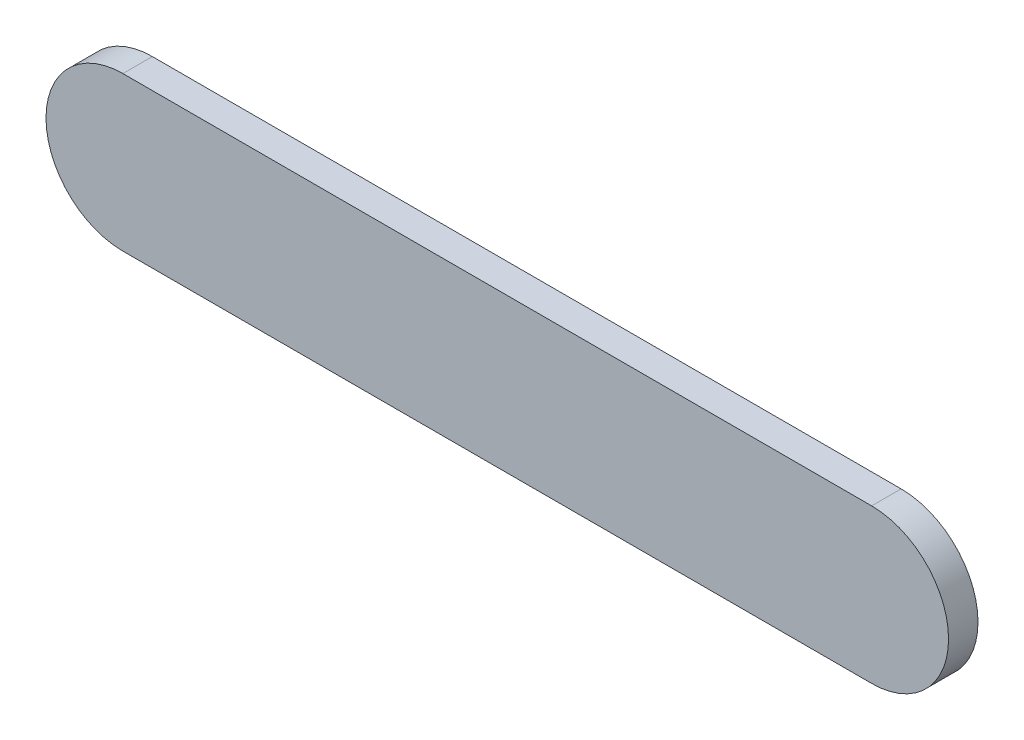
ISO-10303-21;
HEADER;
FILE_DESCRIPTION(('STEP AP214'),'2;1');
FILE_NAME('part.step','',(''),(''),'','','');
FILE_SCHEMA(('AUTOMOTIVE_DESIGN { 1 0 10303 214 1 1 1 1 }'));
ENDSEC;
DATA;
#1=APPLICATION_CONTEXT('core data for automotive mechanical design processes');
#2=APPLICATION_PROTOCOL_DEFINITION('international standard','automotive_design',2000,#1);
#3=PRODUCT_CONTEXT('',#1,'mechanical');
#4=PRODUCT('Part','Part','',(#3));
#5=PRODUCT_RELATED_PRODUCT_CATEGORY('part','',(#4));
#6=PRODUCT_DEFINITION_FORMATION('','',#4);
#7=PRODUCT_DEFINITION_CONTEXT('part definition',#1,'design');
#8=PRODUCT_DEFINITION('design','',#6,#7);
#9=PRODUCT_DEFINITION_SHAPE('','',#8);
#10=(LENGTH_UNIT() NAMED_UNIT(*) SI_UNIT(.MILLI.,.METRE.));
#11=(NAMED_UNIT(*) PLANE_ANGLE_UNIT() SI_UNIT($,.RADIAN.));
#12=(NAMED_UNIT(*) SI_UNIT($,.STERADIAN.) SOLID_ANGLE_UNIT());
#13=UNCERTAINTY_MEASURE_WITH_UNIT(LENGTH_MEASURE(1.E-05),#10,'distance_accuracy_value','');
#14=(GEOMETRIC_REPRESENTATION_CONTEXT(3) GLOBAL_UNCERTAINTY_ASSIGNED_CONTEXT((#13)) GLOBAL_UNIT_ASSIGNED_CONTEXT((#10,
#11,#12)) REPRESENTATION_CONTEXT('',''));
#15=CARTESIAN_POINT('',(0.,0.,0.));
#16=DIRECTION('',(0.,0.,1.));
#17=DIRECTION('',(1.,0.,0.));
#18=AXIS2_PLACEMENT_3D('',#15,#16,#17);
#19=CARTESIAN_POINT('',(0.,0.,6.));
#20=DIRECTION('',(0.,0.,-1.));
#21=DIRECTION('',(-1.,0.,0.));
#22=AXIS2_PLACEMENT_3D('',#19,#20,#21);
#23=CYLINDRICAL_SURFACE('',#22,15.66);
#24=CARTESIAN_POINT('',(0.,0.,0.));
#25=DIRECTION('',(0.,0.,1.));
#26=DIRECTION('',(1.,0.,0.));
#27=AXIS2_PLACEMENT_3D('',#24,#25,#26);
#28=CIRCLE('',#27,15.66);
#29=CARTESIAN_POINT('',(0.,15.66,0.));
#30=VERTEX_POINT('',#29);
#31=CARTESIAN_POINT('',(0.,-15.66,0.));
#32=VERTEX_POINT('',#31);
#33=EDGE_CURVE('E98',#30,#32,#28,.T.);
#34=ORIENTED_EDGE('',*,*,#33,.T.);
#35=DIRECTION('',(0.,0.,-1.));
#36=VECTOR('',#35,1.);
#37=CARTESIAN_POINT('',(0.,-15.66,6.));
#38=LINE('',#37,#36);
#39=CARTESIAN_POINT('',(0.,-15.66,6.));
#40=VERTEX_POINT('',#39);
#41=EDGE_CURVE('E11',#40,#32,#38,.T.);
#42=ORIENTED_EDGE('',*,*,#41,.F.);
#43=CARTESIAN_POINT('',(0.,0.,6.));
#44=DIRECTION('',(0.,0.,1.));
#45=DIRECTION('',(1.,0.,0.));
#46=AXIS2_PLACEMENT_3D('',#43,#44,#45);
#47=CIRCLE('',#46,15.66);
#48=CARTESIAN_POINT('',(0.,15.66,6.));
#49=VERTEX_POINT('',#48);
#50=EDGE_CURVE('E86',#49,#40,#47,.T.);
#51=ORIENTED_EDGE('',*,*,#50,.F.);
#52=DIRECTION('',(0.,0.,-1.));
#53=VECTOR('',#52,1.);
#54=CARTESIAN_POINT('',(0.,15.66,6.));
#55=LINE('',#54,#53);
#56=EDGE_CURVE('E94',#49,#30,#55,.T.);
#57=ORIENTED_EDGE('',*,*,#56,.T.);
#58=EDGE_LOOP('',(#34,#42,#51,#57));
#59=FACE_BOUND('',#58,.T.);
#60=ADVANCED_FACE('F35',(#59),#23,.T.);
#61=CARTESIAN_POINT('',(0.,-15.66,6.));
#62=DIRECTION('',(0.,1.,0.));
#63=DIRECTION('',(-1.,0.,0.));
#64=AXIS2_PLACEMENT_3D('',#61,#62,#63);
#65=PLANE('',#64);
#66=DIRECTION('',(1.,0.,0.));
#67=VECTOR('',#66,1.);
#68=CARTESIAN_POINT('',(0.,-15.66,0.));
#69=LINE('',#68,#67);
#70=CARTESIAN_POINT('',(152.5,-15.66,0.));
#71=VERTEX_POINT('',#70);
#72=EDGE_CURVE('E90',#32,#71,#69,.T.);
#73=ORIENTED_EDGE('',*,*,#72,.T.);
#74=DIRECTION('',(0.,0.,-1.));
#75=VECTOR('',#74,1.);
#76=CARTESIAN_POINT('',(152.5,-15.66,6.));
#77=LINE('',#76,#75);
#78=CARTESIAN_POINT('',(152.5,-15.66,6.));
#79=VERTEX_POINT('',#78);
#80=EDGE_CURVE('E43',#79,#71,#77,.T.);
#81=ORIENTED_EDGE('',*,*,#80,.F.);
#82=DIRECTION('',(1.,0.,0.));
#83=VECTOR('',#82,1.);
#84=CARTESIAN_POINT('',(0.,-15.66,6.));
#85=LINE('',#84,#83);
#86=EDGE_CURVE('E81',#40,#79,#85,.T.);
#87=ORIENTED_EDGE('',*,*,#86,.F.);
#88=ORIENTED_EDGE('',*,*,#41,.T.);
#89=EDGE_LOOP('',(#73,#81,#87,#88));
#90=FACE_BOUND('',#89,.T.);
#91=ADVANCED_FACE('F89',(#90),#65,.F.);
#92=CARTESIAN_POINT('',(152.5,0.,6.));
#93=DIRECTION('',(0.,0.,-1.));
#94=DIRECTION('',(-1.,0.,0.));
#95=AXIS2_PLACEMENT_3D('',#92,#93,#94);
#96=CYLINDRICAL_SURFACE('',#95,15.66);
#97=CARTESIAN_POINT('',(152.5,0.,0.));
#98=DIRECTION('',(0.,0.,1.));
#99=DIRECTION('',(1.,0.,0.));
#100=AXIS2_PLACEMENT_3D('',#97,#98,#99);
#101=CIRCLE('',#100,15.66);
#102=CARTESIAN_POINT('',(152.5,15.66,0.));
#103=VERTEX_POINT('',#102);
#104=EDGE_CURVE('E68',#71,#103,#101,.T.);
#105=ORIENTED_EDGE('',*,*,#104,.T.);
#106=DIRECTION('',(0.,0.,-1.));
#107=VECTOR('',#106,1.);
#108=CARTESIAN_POINT('',(152.5,15.66,6.));
#109=LINE('',#108,#107);
#110=CARTESIAN_POINT('',(152.5,15.66,6.));
#111=VERTEX_POINT('',#110);
#112=EDGE_CURVE('E91',#111,#103,#109,.T.);
#113=ORIENTED_EDGE('',*,*,#112,.F.);
#114=CARTESIAN_POINT('',(152.5,0.,6.));
#115=DIRECTION('',(0.,0.,1.));
#116=DIRECTION('',(1.,0.,0.));
#117=AXIS2_PLACEMENT_3D('',#114,#115,#116);
#118=CIRCLE('',#117,15.66);
#119=EDGE_CURVE('E84',#79,#111,#118,.T.);
#120=ORIENTED_EDGE('',*,*,#119,.F.);
#121=ORIENTED_EDGE('',*,*,#80,.T.);
#122=EDGE_LOOP('',(#105,#113,#120,#121));
#123=FACE_BOUND('',#122,.T.);
#124=ADVANCED_FACE('F92',(#123),#96,.T.);
#125=CARTESIAN_POINT('',(0.,15.66,6.));
#126=DIRECTION('',(0.,-1.,0.));
#127=DIRECTION('',(1.,0.,0.));
#128=AXIS2_PLACEMENT_3D('',#125,#126,#127);
#129=PLANE('',#128);
#130=DIRECTION('',(-1.,0.,0.));
#131=VECTOR('',#130,1.);
#132=CARTESIAN_POINT('',(0.,15.66,0.));
#133=LINE('',#132,#131);
#134=EDGE_CURVE('E74',#103,#30,#133,.T.);
#135=ORIENTED_EDGE('',*,*,#134,.T.);
#136=ORIENTED_EDGE('',*,*,#56,.F.);
#137=DIRECTION('',(-1.,0.,0.));
#138=VECTOR('',#137,1.);
#139=CARTESIAN_POINT('',(0.,15.66,6.));
#140=LINE('',#139,#138);
#141=EDGE_CURVE('E51',#111,#49,#140,.T.);
#142=ORIENTED_EDGE('',*,*,#141,.F.);
#143=ORIENTED_EDGE('',*,*,#112,.T.);
#144=EDGE_LOOP('',(#135,#136,#142,#143));
#145=FACE_BOUND('',#144,.T.);
#146=ADVANCED_FACE('F105',(#145),#129,.F.);
#147=CARTESIAN_POINT('',(0.,0.,6.));
#148=DIRECTION('',(0.,0.,1.));
#149=DIRECTION('',(1.,0.,0.));
#150=AXIS2_PLACEMENT_3D('',#147,#148,#149);
#151=PLANE('',#150);
#152=ORIENTED_EDGE('',*,*,#50,.T.);
#153=ORIENTED_EDGE('',*,*,#86,.T.);
#154=ORIENTED_EDGE('',*,*,#119,.T.);
#155=ORIENTED_EDGE('',*,*,#141,.T.);
#156=EDGE_LOOP('',(#152,#153,#154,#155));
#157=FACE_BOUND('',#156,.T.);
#158=ADVANCED_FACE('F82',(#157),#151,.T.);
#159=CARTESIAN_POINT('',(0.,0.,0.));
#160=DIRECTION('',(0.,0.,1.));
#161=DIRECTION('',(1.,0.,0.));
#162=AXIS2_PLACEMENT_3D('',#159,#160,#161);
#163=PLANE('',#162);
#164=ORIENTED_EDGE('',*,*,#33,.F.);
#165=ORIENTED_EDGE('',*,*,#134,.F.);
#166=ORIENTED_EDGE('',*,*,#104,.F.);
#167=ORIENTED_EDGE('',*,*,#72,.F.);
#168=EDGE_LOOP('',(#164,#165,#166,#167));
#169=FACE_BOUND('',#168,.T.);
#170=ADVANCED_FACE('F108',(#169),#163,.F.);
#171=CLOSED_SHELL('',(#60,#91,#124,#146,#158,#170));
#172=MANIFOLD_SOLID_BREP('B2',#171);
#173=ADVANCED_BREP_SHAPE_REPRESENTATION('',(#18,#172),#14);
#174=SHAPE_DEFINITION_REPRESENTATION(#9,#173);
ENDSEC;
END-ISO-10303-21;
